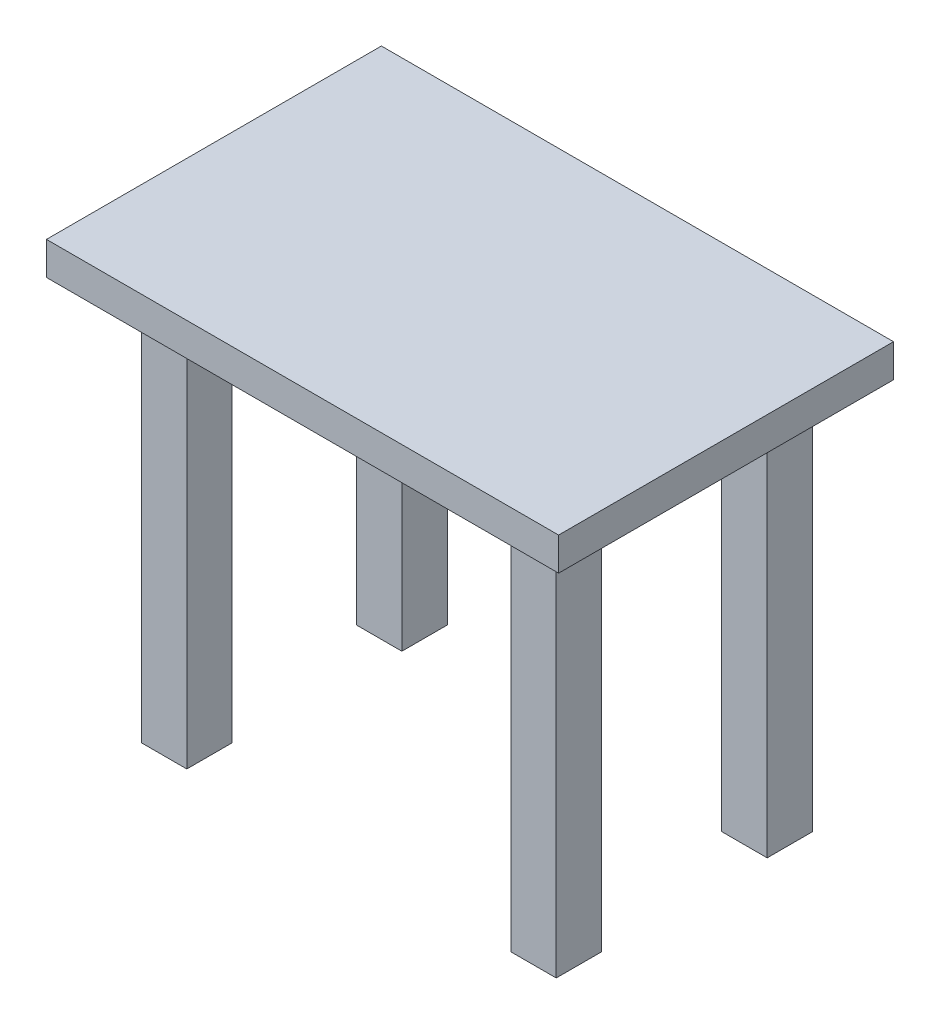
ISO-10303-21;
HEADER;
FILE_DESCRIPTION(('STEP AP214'),'2;1');
FILE_NAME('part.step','',(''),(''),'','','');
FILE_SCHEMA(('AUTOMOTIVE_DESIGN { 1 0 10303 214 1 1 1 1 }'));
ENDSEC;
DATA;
#1=APPLICATION_CONTEXT('core data for automotive mechanical design processes');
#2=APPLICATION_PROTOCOL_DEFINITION('international standard','automotive_design',2000,#1);
#3=PRODUCT_CONTEXT('',#1,'mechanical');
#4=PRODUCT('Part','Part','',(#3));
#5=PRODUCT_RELATED_PRODUCT_CATEGORY('part','',(#4));
#6=PRODUCT_DEFINITION_FORMATION('','',#4);
#7=PRODUCT_DEFINITION_CONTEXT('part definition',#1,'design');
#8=PRODUCT_DEFINITION('design','',#6,#7);
#9=PRODUCT_DEFINITION_SHAPE('','',#8);
#10=(LENGTH_UNIT() NAMED_UNIT(*) SI_UNIT(.MILLI.,.METRE.));
#11=(NAMED_UNIT(*) PLANE_ANGLE_UNIT() SI_UNIT($,.RADIAN.));
#12=(NAMED_UNIT(*) SI_UNIT($,.STERADIAN.) SOLID_ANGLE_UNIT());
#13=UNCERTAINTY_MEASURE_WITH_UNIT(LENGTH_MEASURE(1.E-05),#10,'distance_accuracy_value','');
#14=(GEOMETRIC_REPRESENTATION_CONTEXT(3) GLOBAL_UNCERTAINTY_ASSIGNED_CONTEXT((#13)) GLOBAL_UNIT_ASSIGNED_CONTEXT((#10,
#11,#12)) REPRESENTATION_CONTEXT('',''));
#15=CARTESIAN_POINT('',(0.,0.,0.));
#16=DIRECTION('',(0.,0.,1.));
#17=DIRECTION('',(1.,0.,0.));
#18=AXIS2_PLACEMENT_3D('',#15,#16,#17);
#19=CARTESIAN_POINT('',(-77.6049753603711,-10.,50.750467757662));
#20=DIRECTION('',(-1.,0.,0.));
#21=DIRECTION('',(0.,0.,1.));
#22=AXIS2_PLACEMENT_3D('',#19,#20,#21);
#23=PLANE('',#22);
#24=DIRECTION('',(0.,0.,1.));
#25=VECTOR('',#24,1.);
#26=CARTESIAN_POINT('',(-77.6049753603711,0.,50.750467757662));
#27=LINE('',#26,#25);
#28=CARTESIAN_POINT('',(-77.6049753603711,0.,-50.750467757662));
#29=VERTEX_POINT('',#28);
#30=CARTESIAN_POINT('',(-77.6049753603711,0.,50.750467757662));
#31=VERTEX_POINT('',#30);
#32=EDGE_CURVE('E370',#29,#31,#27,.T.);
#33=ORIENTED_EDGE('',*,*,#32,.F.);
#34=DIRECTION('',(0.,1.,0.));
#35=VECTOR('',#34,1.);
#36=CARTESIAN_POINT('',(-77.6049753603711,-10.,-50.750467757662));
#37=LINE('',#36,#35);
#38=CARTESIAN_POINT('',(-77.6049753603711,-10.,-50.750467757662));
#39=VERTEX_POINT('',#38);
#40=EDGE_CURVE('E11',#39,#29,#37,.T.);
#41=ORIENTED_EDGE('',*,*,#40,.F.);
#42=DIRECTION('',(0.,0.,1.));
#43=VECTOR('',#42,1.);
#44=CARTESIAN_POINT('',(-77.6049753603711,-10.,50.750467757662));
#45=LINE('',#44,#43);
#46=CARTESIAN_POINT('',(-77.6049753603711,-10.,50.750467757662));
#47=VERTEX_POINT('',#46);
#48=EDGE_CURVE('E371',#39,#47,#45,.T.);
#49=ORIENTED_EDGE('',*,*,#48,.T.);
#50=DIRECTION('',(0.,1.,0.));
#51=VECTOR('',#50,1.);
#52=CARTESIAN_POINT('',(-77.6049753603711,-10.,50.750467757662));
#53=LINE('',#52,#51);
#54=EDGE_CURVE('E46',#47,#31,#53,.T.);
#55=ORIENTED_EDGE('',*,*,#54,.T.);
#56=EDGE_LOOP('',(#33,#41,#49,#55));
#57=FACE_BOUND('',#56,.T.);
#58=ADVANCED_FACE('F43',(#57),#23,.T.);
#59=CARTESIAN_POINT('',(77.6049753603711,-10.,-50.750467757662));
#60=DIRECTION('',(0.,0.,-1.));
#61=DIRECTION('',(-1.,0.,0.));
#62=AXIS2_PLACEMENT_3D('',#59,#60,#61);
#63=PLANE('',#62);
#64=DIRECTION('',(-1.,0.,0.));
#65=VECTOR('',#64,1.);
#66=CARTESIAN_POINT('',(77.6049753603711,0.,-50.750467757662));
#67=LINE('',#66,#65);
#68=CARTESIAN_POINT('',(77.6049753603711,0.,-50.750467757662));
#69=VERTEX_POINT('',#68);
#70=EDGE_CURVE('E376',#69,#29,#67,.T.);
#71=ORIENTED_EDGE('',*,*,#70,.F.);
#72=DIRECTION('',(0.,1.,0.));
#73=VECTOR('',#72,1.);
#74=CARTESIAN_POINT('',(77.6049753603711,-10.,-50.750467757662));
#75=LINE('',#74,#73);
#76=CARTESIAN_POINT('',(77.6049753603711,-10.,-50.750467757662));
#77=VERTEX_POINT('',#76);
#78=EDGE_CURVE('E52',#77,#69,#75,.T.);
#79=ORIENTED_EDGE('',*,*,#78,.F.);
#80=DIRECTION('',(-1.,0.,0.));
#81=VECTOR('',#80,1.);
#82=CARTESIAN_POINT('',(77.6049753603711,-10.,-50.750467757662));
#83=LINE('',#82,#81);
#84=EDGE_CURVE('E384',#77,#39,#83,.T.);
#85=ORIENTED_EDGE('',*,*,#84,.T.);
#86=ORIENTED_EDGE('',*,*,#40,.T.);
#87=EDGE_LOOP('',(#71,#79,#85,#86));
#88=FACE_BOUND('',#87,.T.);
#89=ADVANCED_FACE('F418',(#88),#63,.T.);
#90=CARTESIAN_POINT('',(77.6049753603711,-10.,50.750467757662));
#91=DIRECTION('',(1.,0.,0.));
#92=DIRECTION('',(0.,0.,-1.));
#93=AXIS2_PLACEMENT_3D('',#90,#91,#92);
#94=PLANE('',#93);
#95=DIRECTION('',(0.,0.,-1.));
#96=VECTOR('',#95,1.);
#97=CARTESIAN_POINT('',(77.6049753603711,0.,50.750467757662));
#98=LINE('',#97,#96);
#99=CARTESIAN_POINT('',(77.6049753603711,0.,50.750467757662));
#100=VERTEX_POINT('',#99);
#101=EDGE_CURVE('E395',#100,#69,#98,.T.);
#102=ORIENTED_EDGE('',*,*,#101,.F.);
#103=DIRECTION('',(0.,1.,0.));
#104=VECTOR('',#103,1.);
#105=CARTESIAN_POINT('',(77.6049753603711,-10.,50.750467757662));
#106=LINE('',#105,#104);
#107=CARTESIAN_POINT('',(77.6049753603711,-10.,50.750467757662));
#108=VERTEX_POINT('',#107);
#109=EDGE_CURVE('E403',#108,#100,#106,.T.);
#110=ORIENTED_EDGE('',*,*,#109,.F.);
#111=DIRECTION('',(0.,0.,-1.));
#112=VECTOR('',#111,1.);
#113=CARTESIAN_POINT('',(77.6049753603711,-10.,50.750467757662));
#114=LINE('',#113,#112);
#115=EDGE_CURVE('E380',#108,#77,#114,.T.);
#116=ORIENTED_EDGE('',*,*,#115,.T.);
#117=ORIENTED_EDGE('',*,*,#78,.T.);
#118=EDGE_LOOP('',(#102,#110,#116,#117));
#119=FACE_BOUND('',#118,.T.);
#120=ADVANCED_FACE('F424',(#119),#94,.T.);
#121=CARTESIAN_POINT('',(77.6049753603711,-10.,50.750467757662));
#122=DIRECTION('',(0.,0.,1.));
#123=DIRECTION('',(1.,0.,0.));
#124=AXIS2_PLACEMENT_3D('',#121,#122,#123);
#125=PLANE('',#124);
#126=DIRECTION('',(1.,0.,0.));
#127=VECTOR('',#126,1.);
#128=CARTESIAN_POINT('',(77.6049753603711,0.,50.750467757662));
#129=LINE('',#128,#127);
#130=EDGE_CURVE('E391',#31,#100,#129,.T.);
#131=ORIENTED_EDGE('',*,*,#130,.F.);
#132=ORIENTED_EDGE('',*,*,#54,.F.);
#133=DIRECTION('',(1.,0.,0.));
#134=VECTOR('',#133,1.);
#135=CARTESIAN_POINT('',(77.6049753603711,-10.,50.750467757662));
#136=LINE('',#135,#134);
#137=EDGE_CURVE('E375',#47,#108,#136,.T.);
#138=ORIENTED_EDGE('',*,*,#137,.T.);
#139=ORIENTED_EDGE('',*,*,#109,.T.);
#140=EDGE_LOOP('',(#131,#132,#138,#139));
#141=FACE_BOUND('',#140,.T.);
#142=ADVANCED_FACE('F413',(#141),#125,.T.);
#143=CARTESIAN_POINT('',(0.,-10.,0.));
#144=DIRECTION('',(0.,1.,0.));
#145=DIRECTION('',(0.,0.,1.));
#146=AXIS2_PLACEMENT_3D('',#143,#144,#145);
#147=PLANE('',#146);
#148=DIRECTION('',(-1.,0.,0.));
#149=VECTOR('',#148,1.);
#150=CARTESIAN_POINT('',(0.,-10.,23.5990824660785));
#151=LINE('',#150,#149);
#152=CARTESIAN_POINT('',(63.4927694920684,-9.99999999999999,23.5990824660785));
#153=VERTEX_POINT('',#152);
#154=CARTESIAN_POINT('',(49.7266380535226,-9.99999999999999,23.5990824660785));
#155=VERTEX_POINT('',#154);
#156=EDGE_CURVE('E226',#153,#155,#151,.T.);
#157=ORIENTED_EDGE('',*,*,#156,.T.);
#158=DIRECTION('',(0.,0.,1.));
#159=VECTOR('',#158,1.);
#160=CARTESIAN_POINT('',(49.7266380535226,-10.,0.));
#161=LINE('',#160,#159);
#162=CARTESIAN_POINT('',(49.7266380535226,-9.99999999999999,37.3652139046243));
#163=VERTEX_POINT('',#162);
#164=EDGE_CURVE('E187',#155,#163,#161,.T.);
#165=ORIENTED_EDGE('',*,*,#164,.T.);
#166=DIRECTION('',(1.,0.,0.));
#167=VECTOR('',#166,1.);
#168=CARTESIAN_POINT('',(0.,-10.,37.3652139046243));
#169=LINE('',#168,#167);
#170=CARTESIAN_POINT('',(63.4927694920684,-10.,37.3652139046243));
#171=VERTEX_POINT('',#170);
#172=EDGE_CURVE('E202',#163,#171,#169,.T.);
#173=ORIENTED_EDGE('',*,*,#172,.T.);
#174=DIRECTION('',(0.,0.,-1.));
#175=VECTOR('',#174,1.);
#176=CARTESIAN_POINT('',(63.4927694920684,-10.,0.));
#177=LINE('',#176,#175);
#178=EDGE_CURVE('E222',#171,#153,#177,.T.);
#179=ORIENTED_EDGE('',*,*,#178,.T.);
#180=EDGE_LOOP('',(#157,#165,#173,#179));
#181=FACE_BOUND('',#180,.T.);
#182=DIRECTION('',(-1.,0.,0.));
#183=VECTOR('',#182,1.);
#184=CARTESIAN_POINT('',(0.,-10.,24.7228482977965));
#185=LINE('',#184,#183);
#186=CARTESIAN_POINT('',(-47.3386356611218,-9.99999999999999,24.7228482977965));
#187=VERTEX_POINT('',#186);
#188=CARTESIAN_POINT('',(-61.1047670996676,-9.99999999999999,24.7228482977965));
#189=VERTEX_POINT('',#188);
#190=EDGE_CURVE('E268',#187,#189,#185,.T.);
#191=ORIENTED_EDGE('',*,*,#190,.T.);
#192=DIRECTION('',(0.,0.,1.));
#193=VECTOR('',#192,1.);
#194=CARTESIAN_POINT('',(-61.1047670996676,-10.,0.));
#195=LINE('',#194,#193);
#196=CARTESIAN_POINT('',(-61.1047670996676,-9.99999999999999,38.4889797363424));
#197=VERTEX_POINT('',#196);
#198=EDGE_CURVE('E272',#189,#197,#195,.T.);
#199=ORIENTED_EDGE('',*,*,#198,.T.);
#200=DIRECTION('',(1.,0.,0.));
#201=VECTOR('',#200,1.);
#202=CARTESIAN_POINT('',(0.,-10.,38.4889797363424));
#203=LINE('',#202,#201);
#204=CARTESIAN_POINT('',(-47.3386356611218,-10.,38.4889797363424));
#205=VERTEX_POINT('',#204);
#206=EDGE_CURVE('E260',#197,#205,#203,.T.);
#207=ORIENTED_EDGE('',*,*,#206,.T.);
#208=DIRECTION('',(0.,0.,-1.));
#209=VECTOR('',#208,1.);
#210=CARTESIAN_POINT('',(-47.3386356611218,-10.,0.));
#211=LINE('',#210,#209);
#212=EDGE_CURVE('E264',#205,#187,#211,.T.);
#213=ORIENTED_EDGE('',*,*,#212,.T.);
#214=EDGE_LOOP('',(#191,#199,#207,#213));
#215=FACE_BOUND('',#214,.T.);
#216=DIRECTION('',(-1.,0.,0.));
#217=VECTOR('',#216,1.);
#218=CARTESIAN_POINT('',(0.,-10.,-39.8939942559301));
#219=LINE('',#218,#217);
#220=CARTESIAN_POINT('',(63.931237041477,-9.99999999999999,-39.8939942559301));
#221=VERTEX_POINT('',#220);
#222=CARTESIAN_POINT('',(50.1651056029312,-9.99999999999999,-39.8939942559301));
#223=VERTEX_POINT('',#222);
#224=EDGE_CURVE('E315',#221,#223,#219,.T.);
#225=ORIENTED_EDGE('',*,*,#224,.T.);
#226=DIRECTION('',(0.,0.,1.));
#227=VECTOR('',#226,1.);
#228=CARTESIAN_POINT('',(50.1651056029312,-10.,0.));
#229=LINE('',#228,#227);
#230=CARTESIAN_POINT('',(50.1651056029312,-9.99999999999999,-26.1278628173843));
#231=VERTEX_POINT('',#230);
#232=EDGE_CURVE('E319',#223,#231,#229,.T.);
#233=ORIENTED_EDGE('',*,*,#232,.T.);
#234=DIRECTION('',(1.,0.,0.));
#235=VECTOR('',#234,1.);
#236=CARTESIAN_POINT('',(0.,-10.,-26.1278628173843));
#237=LINE('',#236,#235);
#238=CARTESIAN_POINT('',(63.931237041477,-10.,-26.1278628173843));
#239=VERTEX_POINT('',#238);
#240=EDGE_CURVE('E307',#231,#239,#237,.T.);
#241=ORIENTED_EDGE('',*,*,#240,.T.);
#242=DIRECTION('',(0.,0.,-1.));
#243=VECTOR('',#242,1.);
#244=CARTESIAN_POINT('',(63.931237041477,-10.,0.));
#245=LINE('',#244,#243);
#246=EDGE_CURVE('E311',#239,#221,#245,.T.);
#247=ORIENTED_EDGE('',*,*,#246,.T.);
#248=EDGE_LOOP('',(#225,#233,#241,#247));
#249=FACE_BOUND('',#248,.T.);
#250=DIRECTION('',(-1.,0.,0.));
#251=VECTOR('',#250,1.);
#252=CARTESIAN_POINT('',(0.,-10.,-38.7699211942719));
#253=LINE('',#252,#251);
#254=CARTESIAN_POINT('',(-45.6529869135448,-9.99999999999999,-38.7699211942719));
#255=VERTEX_POINT('',#254);
#256=CARTESIAN_POINT('',(-59.4191183520906,-9.99999999999999,-38.7699211942719));
#257=VERTEX_POINT('',#256);
#258=EDGE_CURVE('E362',#255,#257,#253,.T.);
#259=ORIENTED_EDGE('',*,*,#258,.T.);
#260=DIRECTION('',(0.,0.,1.));
#261=VECTOR('',#260,1.);
#262=CARTESIAN_POINT('',(-59.4191183520906,-10.,0.));
#263=LINE('',#262,#261);
#264=CARTESIAN_POINT('',(-59.4191183520906,-9.99999999999999,-25.0037897557261));
#265=VERTEX_POINT('',#264);
#266=EDGE_CURVE('E366',#257,#265,#263,.T.);
#267=ORIENTED_EDGE('',*,*,#266,.T.);
#268=DIRECTION('',(1.,0.,0.));
#269=VECTOR('',#268,1.);
#270=CARTESIAN_POINT('',(0.,-10.,-25.0037897557261));
#271=LINE('',#270,#269);
#272=CARTESIAN_POINT('',(-45.6529869135448,-10.,-25.0037897557261));
#273=VERTEX_POINT('',#272);
#274=EDGE_CURVE('E344',#265,#273,#271,.T.);
#275=ORIENTED_EDGE('',*,*,#274,.T.);
#276=DIRECTION('',(0.,0.,-1.));
#277=VECTOR('',#276,1.);
#278=CARTESIAN_POINT('',(-45.6529869135448,-10.,0.));
#279=LINE('',#278,#277);
#280=EDGE_CURVE('E358',#273,#255,#279,.T.);
#281=ORIENTED_EDGE('',*,*,#280,.T.);
#282=EDGE_LOOP('',(#259,#267,#275,#281));
#283=FACE_BOUND('',#282,.T.);
#284=ORIENTED_EDGE('',*,*,#48,.F.);
#285=ORIENTED_EDGE('',*,*,#84,.F.);
#286=ORIENTED_EDGE('',*,*,#115,.F.);
#287=ORIENTED_EDGE('',*,*,#137,.F.);
#288=EDGE_LOOP('',(#284,#285,#286,#287));
#289=FACE_BOUND('',#288,.T.);
#290=ADVANCED_FACE('F421',(#181,#215,#249,#283,#289),#147,.F.);
#291=CARTESIAN_POINT('',(0.,0.,0.));
#292=DIRECTION('',(0.,1.,0.));
#293=DIRECTION('',(0.,0.,1.));
#294=AXIS2_PLACEMENT_3D('',#291,#292,#293);
#295=PLANE('',#294);
#296=ORIENTED_EDGE('',*,*,#32,.T.);
#297=ORIENTED_EDGE('',*,*,#130,.T.);
#298=ORIENTED_EDGE('',*,*,#101,.T.);
#299=ORIENTED_EDGE('',*,*,#70,.T.);
#300=EDGE_LOOP('',(#296,#297,#298,#299));
#301=FACE_BOUND('',#300,.T.);
#302=ADVANCED_FACE('F415',(#301),#295,.T.);
#303=CARTESIAN_POINT('',(-59.4191183520906,-130.,-25.0037897557261));
#304=DIRECTION('',(-1.,0.,0.));
#305=DIRECTION('',(0.,0.,1.));
#306=AXIS2_PLACEMENT_3D('',#303,#304,#305);
#307=PLANE('',#306);
#308=ORIENTED_EDGE('',*,*,#266,.F.);
#309=DIRECTION('',(0.,1.,0.));
#310=VECTOR('',#309,1.);
#311=CARTESIAN_POINT('',(-59.4191183520906,-130.,-38.7699211942719));
#312=LINE('',#311,#310);
#313=CARTESIAN_POINT('',(-59.4191183520906,-130.,-38.7699211942719));
#314=VERTEX_POINT('',#313);
#315=EDGE_CURVE('E340',#314,#257,#312,.T.);
#316=ORIENTED_EDGE('',*,*,#315,.F.);
#317=DIRECTION('',(0.,0.,1.));
#318=VECTOR('',#317,1.);
#319=CARTESIAN_POINT('',(-59.4191183520906,-130.,-25.0037897557261));
#320=LINE('',#319,#318);
#321=CARTESIAN_POINT('',(-59.4191183520906,-130.,-25.0037897557261));
#322=VERTEX_POINT('',#321);
#323=EDGE_CURVE('E323',#314,#322,#320,.T.);
#324=ORIENTED_EDGE('',*,*,#323,.T.);
#325=DIRECTION('',(0.,1.,0.));
#326=VECTOR('',#325,1.);
#327=CARTESIAN_POINT('',(-59.4191183520906,-130.,-25.0037897557261));
#328=LINE('',#327,#326);
#329=EDGE_CURVE('E339',#322,#265,#328,.T.);
#330=ORIENTED_EDGE('',*,*,#329,.T.);
#331=EDGE_LOOP('',(#308,#316,#324,#330));
#332=FACE_BOUND('',#331,.T.);
#333=ADVANCED_FACE('F471',(#332),#307,.T.);
#334=CARTESIAN_POINT('',(-45.6529869135448,-130.,-38.7699211942719));
#335=DIRECTION('',(0.,0.,-1.));
#336=DIRECTION('',(-1.,0.,0.));
#337=AXIS2_PLACEMENT_3D('',#334,#335,#336);
#338=PLANE('',#337);
#339=ORIENTED_EDGE('',*,*,#258,.F.);
#340=DIRECTION('',(0.,1.,0.));
#341=VECTOR('',#340,1.);
#342=CARTESIAN_POINT('',(-45.6529869135448,-130.,-38.7699211942719));
#343=LINE('',#342,#341);
#344=CARTESIAN_POINT('',(-45.6529869135448,-130.,-38.7699211942719));
#345=VERTEX_POINT('',#344);
#346=EDGE_CURVE('E345',#345,#255,#343,.T.);
#347=ORIENTED_EDGE('',*,*,#346,.F.);
#348=DIRECTION('',(-1.,0.,0.));
#349=VECTOR('',#348,1.);
#350=CARTESIAN_POINT('',(-45.6529869135448,-130.,-38.7699211942719));
#351=LINE('',#350,#349);
#352=EDGE_CURVE('E335',#345,#314,#351,.T.);
#353=ORIENTED_EDGE('',*,*,#352,.T.);
#354=ORIENTED_EDGE('',*,*,#315,.T.);
#355=EDGE_LOOP('',(#339,#347,#353,#354));
#356=FACE_BOUND('',#355,.T.);
#357=ADVANCED_FACE('F481',(#356),#338,.T.);
#358=CARTESIAN_POINT('',(-45.6529869135448,-130.,-25.0037897557261));
#359=DIRECTION('',(1.,0.,0.));
#360=DIRECTION('',(0.,0.,-1.));
#361=AXIS2_PLACEMENT_3D('',#358,#359,#360);
#362=PLANE('',#361);
#363=ORIENTED_EDGE('',*,*,#280,.F.);
#364=DIRECTION('',(0.,1.,0.));
#365=VECTOR('',#364,1.);
#366=CARTESIAN_POINT('',(-45.6529869135448,-130.,-25.0037897557261));
#367=LINE('',#366,#365);
#368=CARTESIAN_POINT('',(-45.6529869135448,-130.,-25.0037897557261));
#369=VERTEX_POINT('',#368);
#370=EDGE_CURVE('E349',#369,#273,#367,.T.);
#371=ORIENTED_EDGE('',*,*,#370,.F.);
#372=DIRECTION('',(0.,0.,-1.));
#373=VECTOR('',#372,1.);
#374=CARTESIAN_POINT('',(-45.6529869135448,-130.,-25.0037897557261));
#375=LINE('',#374,#373);
#376=EDGE_CURVE('E331',#369,#345,#375,.T.);
#377=ORIENTED_EDGE('',*,*,#376,.T.);
#378=ORIENTED_EDGE('',*,*,#346,.T.);
#379=EDGE_LOOP('',(#363,#371,#377,#378));
#380=FACE_BOUND('',#379,.T.);
#381=ADVANCED_FACE('F492',(#380),#362,.T.);
#382=CARTESIAN_POINT('',(-45.6529869135448,-130.,-25.0037897557261));
#383=DIRECTION('',(0.,0.,1.));
#384=DIRECTION('',(1.,0.,0.));
#385=AXIS2_PLACEMENT_3D('',#382,#383,#384);
#386=PLANE('',#385);
#387=ORIENTED_EDGE('',*,*,#274,.F.);
#388=ORIENTED_EDGE('',*,*,#329,.F.);
#389=DIRECTION('',(1.,0.,0.));
#390=VECTOR('',#389,1.);
#391=CARTESIAN_POINT('',(-45.6529869135448,-130.,-25.0037897557261));
#392=LINE('',#391,#390);
#393=EDGE_CURVE('E327',#322,#369,#392,.T.);
#394=ORIENTED_EDGE('',*,*,#393,.T.);
#395=ORIENTED_EDGE('',*,*,#370,.T.);
#396=EDGE_LOOP('',(#387,#388,#394,#395));
#397=FACE_BOUND('',#396,.T.);
#398=ADVANCED_FACE('F503',(#397),#386,.T.);
#399=CARTESIAN_POINT('',(0.,-130.,0.));
#400=DIRECTION('',(0.,1.,0.));
#401=DIRECTION('',(0.,0.,1.));
#402=AXIS2_PLACEMENT_3D('',#399,#400,#401);
#403=PLANE('',#402);
#404=ORIENTED_EDGE('',*,*,#323,.F.);
#405=ORIENTED_EDGE('',*,*,#352,.F.);
#406=ORIENTED_EDGE('',*,*,#376,.F.);
#407=ORIENTED_EDGE('',*,*,#393,.F.);
#408=EDGE_LOOP('',(#404,#405,#406,#407));
#409=FACE_BOUND('',#408,.T.);
#410=ADVANCED_FACE('F514',(#409),#403,.F.);
#411=CARTESIAN_POINT('',(50.1651056029312,-130.,-26.1278628173843));
#412=DIRECTION('',(-1.,0.,0.));
#413=DIRECTION('',(0.,0.,1.));
#414=AXIS2_PLACEMENT_3D('',#411,#412,#413);
#415=PLANE('',#414);
#416=ORIENTED_EDGE('',*,*,#232,.F.);
#417=DIRECTION('',(0.,1.,0.));
#418=VECTOR('',#417,1.);
#419=CARTESIAN_POINT('',(50.1651056029312,-130.,-39.8939942559301));
#420=LINE('',#419,#418);
#421=CARTESIAN_POINT('',(50.1651056029312,-130.,-39.8939942559301));
#422=VERTEX_POINT('',#421);
#423=EDGE_CURVE('E276',#422,#223,#420,.T.);
#424=ORIENTED_EDGE('',*,*,#423,.F.);
#425=DIRECTION('',(0.,0.,1.));
#426=VECTOR('',#425,1.);
#427=CARTESIAN_POINT('',(50.1651056029312,-130.,-26.1278628173843));
#428=LINE('',#427,#426);
#429=CARTESIAN_POINT('',(50.1651056029312,-130.,-26.1278628173843));
#430=VERTEX_POINT('',#429);
#431=EDGE_CURVE('E303',#422,#430,#428,.T.);
#432=ORIENTED_EDGE('',*,*,#431,.T.);
#433=DIRECTION('',(0.,1.,0.));
#434=VECTOR('',#433,1.);
#435=CARTESIAN_POINT('',(50.1651056029312,-130.,-26.1278628173843));
#436=LINE('',#435,#434);
#437=EDGE_CURVE('E277',#430,#231,#436,.T.);
#438=ORIENTED_EDGE('',*,*,#437,.T.);
#439=EDGE_LOOP('',(#416,#424,#432,#438));
#440=FACE_BOUND('',#439,.T.);
#441=ADVANCED_FACE('F525',(#440),#415,.T.);
#442=CARTESIAN_POINT('',(63.931237041477,-130.,-39.8939942559301));
#443=DIRECTION('',(0.,0.,-1.));
#444=DIRECTION('',(-1.,0.,0.));
#445=AXIS2_PLACEMENT_3D('',#442,#443,#444);
#446=PLANE('',#445);
#447=ORIENTED_EDGE('',*,*,#224,.F.);
#448=DIRECTION('',(0.,1.,0.));
#449=VECTOR('',#448,1.);
#450=CARTESIAN_POINT('',(63.931237041477,-130.,-39.8939942559301));
#451=LINE('',#450,#449);
#452=CARTESIAN_POINT('',(63.931237041477,-130.,-39.8939942559301));
#453=VERTEX_POINT('',#452);
#454=EDGE_CURVE('E285',#453,#221,#451,.T.);
#455=ORIENTED_EDGE('',*,*,#454,.F.);
#456=DIRECTION('',(-1.,0.,0.));
#457=VECTOR('',#456,1.);
#458=CARTESIAN_POINT('',(63.931237041477,-130.,-39.8939942559301));
#459=LINE('',#458,#457);
#460=EDGE_CURVE('E281',#453,#422,#459,.T.);
#461=ORIENTED_EDGE('',*,*,#460,.T.);
#462=ORIENTED_EDGE('',*,*,#423,.T.);
#463=EDGE_LOOP('',(#447,#455,#461,#462));
#464=FACE_BOUND('',#463,.T.);
#465=ADVANCED_FACE('F536',(#464),#446,.T.);
#466=CARTESIAN_POINT('',(63.931237041477,-130.,-26.1278628173843));
#467=DIRECTION('',(1.,0.,0.));
#468=DIRECTION('',(0.,0.,-1.));
#469=AXIS2_PLACEMENT_3D('',#466,#467,#468);
#470=PLANE('',#469);
#471=ORIENTED_EDGE('',*,*,#246,.F.);
#472=DIRECTION('',(0.,1.,0.));
#473=VECTOR('',#472,1.);
#474=CARTESIAN_POINT('',(63.931237041477,-130.,-26.1278628173843));
#475=LINE('',#474,#473);
#476=CARTESIAN_POINT('',(63.931237041477,-130.,-26.1278628173843));
#477=VERTEX_POINT('',#476);
#478=EDGE_CURVE('E282',#477,#239,#475,.T.);
#479=ORIENTED_EDGE('',*,*,#478,.F.);
#480=DIRECTION('',(0.,0.,-1.));
#481=VECTOR('',#480,1.);
#482=CARTESIAN_POINT('',(63.931237041477,-130.,-26.1278628173843));
#483=LINE('',#482,#481);
#484=EDGE_CURVE('E295',#477,#453,#483,.T.);
#485=ORIENTED_EDGE('',*,*,#484,.T.);
#486=ORIENTED_EDGE('',*,*,#454,.T.);
#487=EDGE_LOOP('',(#471,#479,#485,#486));
#488=FACE_BOUND('',#487,.T.);
#489=ADVANCED_FACE('F547',(#488),#470,.T.);
#490=CARTESIAN_POINT('',(63.931237041477,-130.,-26.1278628173843));
#491=DIRECTION('',(0.,0.,1.));
#492=DIRECTION('',(1.,0.,0.));
#493=AXIS2_PLACEMENT_3D('',#490,#491,#492);
#494=PLANE('',#493);
#495=ORIENTED_EDGE('',*,*,#240,.F.);
#496=ORIENTED_EDGE('',*,*,#437,.F.);
#497=DIRECTION('',(1.,0.,0.));
#498=VECTOR('',#497,1.);
#499=CARTESIAN_POINT('',(63.931237041477,-130.,-26.1278628173843));
#500=LINE('',#499,#498);
#501=EDGE_CURVE('E299',#430,#477,#500,.T.);
#502=ORIENTED_EDGE('',*,*,#501,.T.);
#503=ORIENTED_EDGE('',*,*,#478,.T.);
#504=EDGE_LOOP('',(#495,#496,#502,#503));
#505=FACE_BOUND('',#504,.T.);
#506=ADVANCED_FACE('F558',(#505),#494,.T.);
#507=CARTESIAN_POINT('',(0.,-130.,0.));
#508=DIRECTION('',(0.,1.,0.));
#509=DIRECTION('',(0.,0.,1.));
#510=AXIS2_PLACEMENT_3D('',#507,#508,#509);
#511=PLANE('',#510);
#512=ORIENTED_EDGE('',*,*,#431,.F.);
#513=ORIENTED_EDGE('',*,*,#460,.F.);
#514=ORIENTED_EDGE('',*,*,#484,.F.);
#515=ORIENTED_EDGE('',*,*,#501,.F.);
#516=EDGE_LOOP('',(#512,#513,#514,#515));
#517=FACE_BOUND('',#516,.T.);
#518=ADVANCED_FACE('F569',(#517),#511,.F.);
#519=CARTESIAN_POINT('',(-61.1047670996676,-130.,38.4889797363424));
#520=DIRECTION('',(-1.,0.,0.));
#521=DIRECTION('',(0.,0.,1.));
#522=AXIS2_PLACEMENT_3D('',#519,#520,#521);
#523=PLANE('',#522);
#524=ORIENTED_EDGE('',*,*,#198,.F.);
#525=DIRECTION('',(0.,1.,0.));
#526=VECTOR('',#525,1.);
#527=CARTESIAN_POINT('',(-61.1047670996676,-130.,24.7228482977965));
#528=LINE('',#527,#526);
#529=CARTESIAN_POINT('',(-61.1047670996676,-130.,24.7228482977965));
#530=VERTEX_POINT('',#529);
#531=EDGE_CURVE('E231',#530,#189,#528,.T.);
#532=ORIENTED_EDGE('',*,*,#531,.F.);
#533=DIRECTION('',(0.,0.,1.));
#534=VECTOR('',#533,1.);
#535=CARTESIAN_POINT('',(-61.1047670996676,-130.,38.4889797363424));
#536=LINE('',#535,#534);
#537=CARTESIAN_POINT('',(-61.1047670996676,-130.,38.4889797363424));
#538=VERTEX_POINT('',#537);
#539=EDGE_CURVE('E256',#530,#538,#536,.T.);
#540=ORIENTED_EDGE('',*,*,#539,.T.);
#541=DIRECTION('',(0.,1.,0.));
#542=VECTOR('',#541,1.);
#543=CARTESIAN_POINT('',(-61.1047670996676,-130.,38.4889797363424));
#544=LINE('',#543,#542);
#545=EDGE_CURVE('E232',#538,#197,#544,.T.);
#546=ORIENTED_EDGE('',*,*,#545,.T.);
#547=EDGE_LOOP('',(#524,#532,#540,#546));
#548=FACE_BOUND('',#547,.T.);
#549=ADVANCED_FACE('F580',(#548),#523,.T.);
#550=CARTESIAN_POINT('',(-47.3386356611218,-130.,24.7228482977965));
#551=DIRECTION('',(0.,0.,-1.));
#552=DIRECTION('',(-1.,0.,0.));
#553=AXIS2_PLACEMENT_3D('',#550,#551,#552);
#554=PLANE('',#553);
#555=ORIENTED_EDGE('',*,*,#190,.F.);
#556=DIRECTION('',(0.,1.,0.));
#557=VECTOR('',#556,1.);
#558=CARTESIAN_POINT('',(-47.3386356611218,-130.,24.7228482977965));
#559=LINE('',#558,#557);
#560=CARTESIAN_POINT('',(-47.3386356611218,-130.,24.7228482977965));
#561=VERTEX_POINT('',#560);
#562=EDGE_CURVE('E239',#561,#187,#559,.T.);
#563=ORIENTED_EDGE('',*,*,#562,.F.);
#564=DIRECTION('',(-1.,0.,0.));
#565=VECTOR('',#564,1.);
#566=CARTESIAN_POINT('',(-47.3386356611218,-130.,24.7228482977965));
#567=LINE('',#566,#565);
#568=EDGE_CURVE('E236',#561,#530,#567,.T.);
#569=ORIENTED_EDGE('',*,*,#568,.T.);
#570=ORIENTED_EDGE('',*,*,#531,.T.);
#571=EDGE_LOOP('',(#555,#563,#569,#570));
#572=FACE_BOUND('',#571,.T.);
#573=ADVANCED_FACE('F591',(#572),#554,.T.);
#574=CARTESIAN_POINT('',(-47.3386356611218,-130.,38.4889797363424));
#575=DIRECTION('',(1.,0.,0.));
#576=DIRECTION('',(0.,0.,-1.));
#577=AXIS2_PLACEMENT_3D('',#574,#575,#576);
#578=PLANE('',#577);
#579=ORIENTED_EDGE('',*,*,#212,.F.);
#580=DIRECTION('',(0.,1.,0.));
#581=VECTOR('',#580,1.);
#582=CARTESIAN_POINT('',(-47.3386356611218,-130.,38.4889797363424));
#583=LINE('',#582,#581);
#584=CARTESIAN_POINT('',(-47.3386356611218,-130.,38.4889797363424));
#585=VERTEX_POINT('',#584);
#586=EDGE_CURVE('E68',#585,#205,#583,.T.);
#587=ORIENTED_EDGE('',*,*,#586,.F.);
#588=DIRECTION('',(0.,0.,-1.));
#589=VECTOR('',#588,1.);
#590=CARTESIAN_POINT('',(-47.3386356611218,-130.,38.4889797363424));
#591=LINE('',#590,#589);
#592=EDGE_CURVE('E249',#585,#561,#591,.T.);
#593=ORIENTED_EDGE('',*,*,#592,.T.);
#594=ORIENTED_EDGE('',*,*,#562,.T.);
#595=EDGE_LOOP('',(#579,#587,#593,#594));
#596=FACE_BOUND('',#595,.T.);
#597=ADVANCED_FACE('F602',(#596),#578,.T.);
#598=CARTESIAN_POINT('',(-47.3386356611218,-130.,38.4889797363424));
#599=DIRECTION('',(0.,0.,1.));
#600=DIRECTION('',(1.,0.,0.));
#601=AXIS2_PLACEMENT_3D('',#598,#599,#600);
#602=PLANE('',#601);
#603=ORIENTED_EDGE('',*,*,#206,.F.);
#604=ORIENTED_EDGE('',*,*,#545,.F.);
#605=DIRECTION('',(1.,0.,0.));
#606=VECTOR('',#605,1.);
#607=CARTESIAN_POINT('',(-47.3386356611218,-130.,38.4889797363424));
#608=LINE('',#607,#606);
#609=EDGE_CURVE('E253',#538,#585,#608,.T.);
#610=ORIENTED_EDGE('',*,*,#609,.T.);
#611=ORIENTED_EDGE('',*,*,#586,.T.);
#612=EDGE_LOOP('',(#603,#604,#610,#611));
#613=FACE_BOUND('',#612,.T.);
#614=ADVANCED_FACE('F613',(#613),#602,.T.);
#615=CARTESIAN_POINT('',(0.,-130.,0.));
#616=DIRECTION('',(0.,1.,0.));
#617=DIRECTION('',(0.,0.,1.));
#618=AXIS2_PLACEMENT_3D('',#615,#616,#617);
#619=PLANE('',#618);
#620=ORIENTED_EDGE('',*,*,#539,.F.);
#621=ORIENTED_EDGE('',*,*,#568,.F.);
#622=ORIENTED_EDGE('',*,*,#592,.F.);
#623=ORIENTED_EDGE('',*,*,#609,.F.);
#624=EDGE_LOOP('',(#620,#621,#622,#623));
#625=FACE_BOUND('',#624,.T.);
#626=ADVANCED_FACE('F624',(#625),#619,.F.);
#627=CARTESIAN_POINT('',(49.7266380535226,-130.,37.3652139046243));
#628=DIRECTION('',(-1.,0.,0.));
#629=DIRECTION('',(0.,0.,1.));
#630=AXIS2_PLACEMENT_3D('',#627,#628,#629);
#631=PLANE('',#630);
#632=ORIENTED_EDGE('',*,*,#164,.F.);
#633=DIRECTION('',(0.,1.,0.));
#634=VECTOR('',#633,1.);
#635=CARTESIAN_POINT('',(49.7266380535226,-130.,23.5990824660785));
#636=LINE('',#635,#634);
#637=CARTESIAN_POINT('',(49.7266380535226,-130.,23.5990824660785));
#638=VERTEX_POINT('',#637);
#639=EDGE_CURVE('E181',#638,#155,#636,.T.);
#640=ORIENTED_EDGE('',*,*,#639,.F.);
#641=DIRECTION('',(0.,0.,1.));
#642=VECTOR('',#641,1.);
#643=CARTESIAN_POINT('',(49.7266380535226,-130.,37.3652139046243));
#644=LINE('',#643,#642);
#645=CARTESIAN_POINT('',(49.7266380535226,-130.,37.3652139046243));
#646=VERTEX_POINT('',#645);
#647=EDGE_CURVE('E185',#638,#646,#644,.T.);
#648=ORIENTED_EDGE('',*,*,#647,.T.);
#649=DIRECTION('',(0.,1.,0.));
#650=VECTOR('',#649,1.);
#651=CARTESIAN_POINT('',(49.7266380535226,-130.,37.3652139046243));
#652=LINE('',#651,#650);
#653=EDGE_CURVE('E209',#646,#163,#652,.T.);
#654=ORIENTED_EDGE('',*,*,#653,.T.);
#655=EDGE_LOOP('',(#632,#640,#648,#654));
#656=FACE_BOUND('',#655,.T.);
#657=ADVANCED_FACE('F183',(#656),#631,.T.);
#658=CARTESIAN_POINT('',(63.4927694920684,-130.,23.5990824660785));
#659=DIRECTION('',(0.,0.,-1.));
#660=DIRECTION('',(-1.,0.,0.));
#661=AXIS2_PLACEMENT_3D('',#658,#659,#660);
#662=PLANE('',#661);
#663=ORIENTED_EDGE('',*,*,#156,.F.);
#664=DIRECTION('',(0.,1.,0.));
#665=VECTOR('',#664,1.);
#666=CARTESIAN_POINT('',(63.4927694920684,-130.,23.5990824660785));
#667=LINE('',#666,#665);
#668=CARTESIAN_POINT('',(63.4927694920684,-130.,23.5990824660785));
#669=VERTEX_POINT('',#668);
#670=EDGE_CURVE('E192',#669,#153,#667,.T.);
#671=ORIENTED_EDGE('',*,*,#670,.F.);
#672=DIRECTION('',(-1.,0.,0.));
#673=VECTOR('',#672,1.);
#674=CARTESIAN_POINT('',(63.4927694920684,-130.,23.5990824660785));
#675=LINE('',#674,#673);
#676=EDGE_CURVE('E199',#669,#638,#675,.T.);
#677=ORIENTED_EDGE('',*,*,#676,.T.);
#678=ORIENTED_EDGE('',*,*,#639,.T.);
#679=EDGE_LOOP('',(#663,#671,#677,#678));
#680=FACE_BOUND('',#679,.T.);
#681=ADVANCED_FACE('F204',(#680),#662,.T.);
#682=CARTESIAN_POINT('',(63.4927694920684,-130.,37.3652139046243));
#683=DIRECTION('',(1.,0.,0.));
#684=DIRECTION('',(0.,0.,-1.));
#685=AXIS2_PLACEMENT_3D('',#682,#683,#684);
#686=PLANE('',#685);
#687=ORIENTED_EDGE('',*,*,#178,.F.);
#688=DIRECTION('',(0.,1.,0.));
#689=VECTOR('',#688,1.);
#690=CARTESIAN_POINT('',(63.4927694920684,-130.,37.3652139046243));
#691=LINE('',#690,#689);
#692=CARTESIAN_POINT('',(63.4927694920684,-130.,37.3652139046243));
#693=VERTEX_POINT('',#692);
#694=EDGE_CURVE('E60',#693,#171,#691,.T.);
#695=ORIENTED_EDGE('',*,*,#694,.F.);
#696=DIRECTION('',(0.,0.,-1.));
#697=VECTOR('',#696,1.);
#698=CARTESIAN_POINT('',(63.4927694920684,-130.,37.3652139046243));
#699=LINE('',#698,#697);
#700=EDGE_CURVE('E208',#693,#669,#699,.T.);
#701=ORIENTED_EDGE('',*,*,#700,.T.);
#702=ORIENTED_EDGE('',*,*,#670,.T.);
#703=EDGE_LOOP('',(#687,#695,#701,#702));
#704=FACE_BOUND('',#703,.T.);
#705=ADVANCED_FACE('F653',(#704),#686,.T.);
#706=CARTESIAN_POINT('',(63.4927694920684,-130.,37.3652139046243));
#707=DIRECTION('',(0.,0.,1.));
#708=DIRECTION('',(1.,0.,0.));
#709=AXIS2_PLACEMENT_3D('',#706,#707,#708);
#710=PLANE('',#709);
#711=ORIENTED_EDGE('',*,*,#172,.F.);
#712=ORIENTED_EDGE('',*,*,#653,.F.);
#713=DIRECTION('',(1.,0.,0.));
#714=VECTOR('',#713,1.);
#715=CARTESIAN_POINT('',(63.4927694920684,-130.,37.3652139046243));
#716=LINE('',#715,#714);
#717=EDGE_CURVE('E200',#646,#693,#716,.T.);
#718=ORIENTED_EDGE('',*,*,#717,.T.);
#719=ORIENTED_EDGE('',*,*,#694,.T.);
#720=EDGE_LOOP('',(#711,#712,#718,#719));
#721=FACE_BOUND('',#720,.T.);
#722=ADVANCED_FACE('F663',(#721),#710,.T.);
#723=CARTESIAN_POINT('',(0.,-130.,0.));
#724=DIRECTION('',(0.,1.,0.));
#725=DIRECTION('',(0.,0.,1.));
#726=AXIS2_PLACEMENT_3D('',#723,#724,#725);
#727=PLANE('',#726);
#728=ORIENTED_EDGE('',*,*,#647,.F.);
#729=ORIENTED_EDGE('',*,*,#676,.F.);
#730=ORIENTED_EDGE('',*,*,#700,.F.);
#731=ORIENTED_EDGE('',*,*,#717,.F.);
#732=EDGE_LOOP('',(#728,#729,#730,#731));
#733=FACE_BOUND('',#732,.T.);
#734=ADVANCED_FACE('F197',(#733),#727,.F.);
#735=CLOSED_SHELL('',(#58,#89,#120,#142,#290,#302,#333,#357,#381,#398,#410,#441,#465,#489,#506,
#518,#549,#573,#597,#614,#626,#657,#681,#705,#722,#734));
#736=MANIFOLD_SOLID_BREP('B2',#735);
#737=ADVANCED_BREP_SHAPE_REPRESENTATION('',(#18,#736),#14);
#738=SHAPE_DEFINITION_REPRESENTATION(#9,#737);
ENDSEC;
END-ISO-10303-21;
